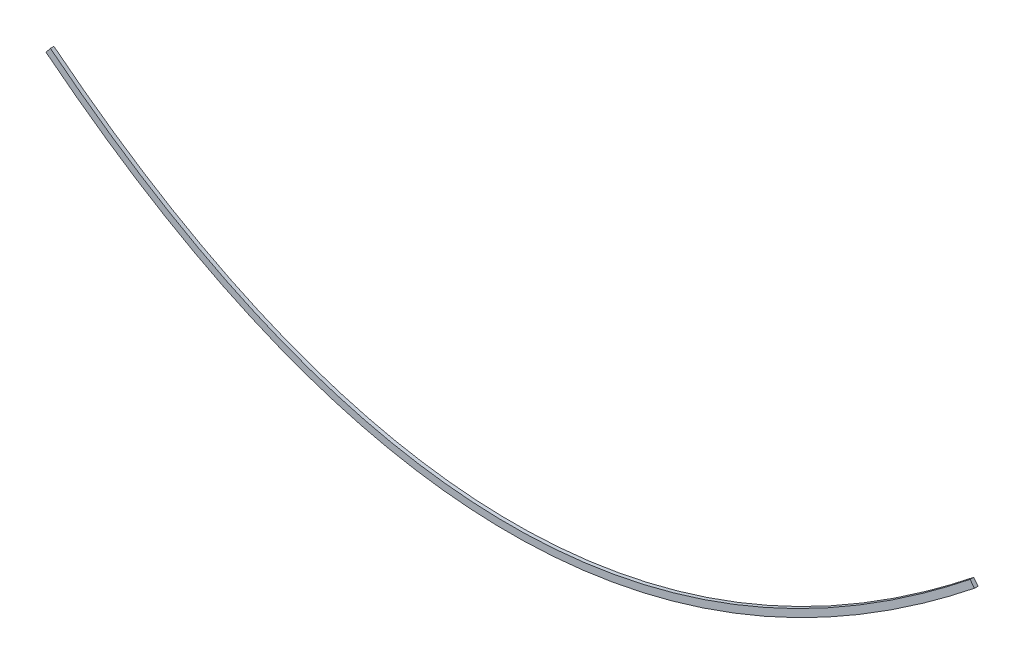
ISO-10303-21;
HEADER;
FILE_DESCRIPTION(('STEP AP214'),'2;1');
FILE_NAME('part.step','',(''),(''),'','','');
FILE_SCHEMA(('AUTOMOTIVE_DESIGN { 1 0 10303 214 1 1 1 1 }'));
ENDSEC;
DATA;
#1=APPLICATION_CONTEXT('core data for automotive mechanical design processes');
#2=APPLICATION_PROTOCOL_DEFINITION('international standard','automotive_design',2000,#1);
#3=PRODUCT_CONTEXT('',#1,'mechanical');
#4=PRODUCT('Part','Part','',(#3));
#5=PRODUCT_RELATED_PRODUCT_CATEGORY('part','',(#4));
#6=PRODUCT_DEFINITION_FORMATION('','',#4);
#7=PRODUCT_DEFINITION_CONTEXT('part definition',#1,'design');
#8=PRODUCT_DEFINITION('design','',#6,#7);
#9=PRODUCT_DEFINITION_SHAPE('','',#8);
#10=(LENGTH_UNIT() NAMED_UNIT(*) SI_UNIT(.MILLI.,.METRE.));
#11=(NAMED_UNIT(*) PLANE_ANGLE_UNIT() SI_UNIT($,.RADIAN.));
#12=(NAMED_UNIT(*) SI_UNIT($,.STERADIAN.) SOLID_ANGLE_UNIT());
#13=UNCERTAINTY_MEASURE_WITH_UNIT(LENGTH_MEASURE(1.E-05),#10,'distance_accuracy_value','');
#14=(GEOMETRIC_REPRESENTATION_CONTEXT(3) GLOBAL_UNCERTAINTY_ASSIGNED_CONTEXT((#13)) GLOBAL_UNIT_ASSIGNED_CONTEXT((#10,
#11,#12)) REPRESENTATION_CONTEXT('',''));
#15=CARTESIAN_POINT('',(0.,0.,0.));
#16=DIRECTION('',(0.,0.,1.));
#17=DIRECTION('',(1.,0.,0.));
#18=AXIS2_PLACEMENT_3D('',#15,#16,#17);
#19=CARTESIAN_POINT('',(-1316.86627778561,513.594593576516,10.));
#20=CARTESIAN_POINT('',(-1207.32856398353,426.438501760189,10.));
#21=CARTESIAN_POINT('',(-1097.74431050093,350.139448286762,10.));
#22=CARTESIAN_POINT('',(-878.464583952773,219.283394350236,10.));
#23=CARTESIAN_POINT('',(-768.768474048777,164.726519406467,10.));
#24=CARTESIAN_POINT('',(-549.264658939787,77.3999996187593,10.));
#25=CARTESIAN_POINT('',(-439.456522515046,44.6311540347239,10.));
#26=CARTESIAN_POINT('',(-219.765390207726,0.930633378408788,10.));
#27=CARTESIAN_POINT('',(-109.883059999976,-10.0000000000088,10.));
#28=CARTESIAN_POINT('',(109.883060000039,-10.0000000000141,10.));
#29=CARTESIAN_POINT('',(219.765390207787,0.930633378398086,10.));
#30=CARTESIAN_POINT('',(439.456522515098,44.6311540347026,10.));
#31=CARTESIAN_POINT('',(549.264658939831,77.3999996187327,10.));
#32=CARTESIAN_POINT('',(768.768474048802,164.72651940643,10.));
#33=CARTESIAN_POINT('',(878.464583952787,219.283394350194,10.));
#34=CARTESIAN_POINT('',(1097.74431050092,350.139448286709,10.));
#35=CARTESIAN_POINT('',(1207.3285639835,426.438501760131,10.));
#36=CARTESIAN_POINT('',(1316.86627778556,513.594593576453,10.));
#37=B_SPLINE_CURVE_WITH_KNOTS('',3,(#19,#20,#21,#22,#23,#24,#25,#26,#27,#28,#29,#30,#31,#32,#33,
#34,#35,#36),.UNSPECIFIED.,.F.,.F.,(4,2,2,2,2,2,2,2,4),(0.,0.125,0.25,0.375,0.5,0.625,0.75,
0.875,1.),.UNSPECIFIED.);
#38=DIRECTION('',(0.,0.,-1.));
#39=VECTOR('',#38,1.);
#40=SURFACE_OF_LINEAR_EXTRUSION('',#37,#39);
#41=CARTESIAN_POINT('',(-1316.86627778561,513.594593576516,0.));
#42=CARTESIAN_POINT('',(-1207.32856398353,426.438501760189,0.));
#43=CARTESIAN_POINT('',(-1097.74431050093,350.139448286762,0.));
#44=CARTESIAN_POINT('',(-878.464583952773,219.283394350236,0.));
#45=CARTESIAN_POINT('',(-768.768474048777,164.726519406467,0.));
#46=CARTESIAN_POINT('',(-549.264658939787,77.3999996187593,0.));
#47=CARTESIAN_POINT('',(-439.456522515046,44.6311540347239,0.));
#48=CARTESIAN_POINT('',(-219.765390207726,0.930633378408788,0.));
#49=CARTESIAN_POINT('',(-109.883059999976,-10.0000000000088,0.));
#50=CARTESIAN_POINT('',(109.883060000039,-10.0000000000141,0.));
#51=CARTESIAN_POINT('',(219.765390207787,0.930633378398086,0.));
#52=CARTESIAN_POINT('',(439.456522515098,44.6311540347026,0.));
#53=CARTESIAN_POINT('',(549.264658939831,77.3999996187327,0.));
#54=CARTESIAN_POINT('',(768.768474048802,164.72651940643,0.));
#55=CARTESIAN_POINT('',(878.464583952787,219.283394350194,0.));
#56=CARTESIAN_POINT('',(1097.74431050092,350.139448286709,0.));
#57=CARTESIAN_POINT('',(1207.3285639835,426.438501760131,0.));
#58=CARTESIAN_POINT('',(1316.86627778556,513.594593576453,0.));
#59=B_SPLINE_CURVE_WITH_KNOTS('',3,(#41,#42,#43,#44,#45,#46,#47,#48,#49,#50,#51,#52,#53,#54,#55,
#56,#57,#58),.UNSPECIFIED.,.F.,.F.,(4,2,2,2,2,2,2,2,4),(0.,0.125,0.25,0.375,0.5,0.625,0.75,
0.875,1.),.UNSPECIFIED.);
#60=CARTESIAN_POINT('',(-1316.86627778561,513.594593576516,0.));
#61=VERTEX_POINT('',#60);
#62=CARTESIAN_POINT('',(1316.86627778556,513.594593576453,0.));
#63=VERTEX_POINT('',#62);
#64=EDGE_CURVE('E128',#61,#63,#59,.T.);
#65=ORIENTED_EDGE('',*,*,#64,.T.);
#66=DIRECTION('',(0.,0.,-1.));
#67=VECTOR('',#66,1.);
#68=CARTESIAN_POINT('',(1316.86627778556,513.594593576453,10.));
#69=LINE('',#68,#67);
#70=CARTESIAN_POINT('',(1316.86627778556,513.594593576453,10.));
#71=VERTEX_POINT('',#70);
#72=EDGE_CURVE('E11',#71,#63,#69,.T.);
#73=ORIENTED_EDGE('',*,*,#72,.F.);
#74=CARTESIAN_POINT('',(-1316.86627778561,513.594593576516,10.));
#75=VERTEX_POINT('',#74);
#76=EDGE_CURVE('E85',#75,#71,#37,.T.);
#77=ORIENTED_EDGE('',*,*,#76,.F.);
#78=DIRECTION('',(0.,0.,-1.));
#79=VECTOR('',#78,1.);
#80=CARTESIAN_POINT('',(-1316.86627778561,513.594593576516,10.));
#81=LINE('',#80,#79);
#82=EDGE_CURVE('E61',#75,#61,#81,.T.);
#83=ORIENTED_EDGE('',*,*,#82,.T.);
#84=EDGE_LOOP('',(#65,#73,#77,#83));
#85=FACE_BOUND('',#84,.T.);
#86=ADVANCED_FACE('F43',(#85),#40,.F.);
#87=CARTESIAN_POINT('',(1304.41372221458,529.244956503609,10.));
#88=DIRECTION('',(0.782518146357816,0.622627778548892,0.));
#89=DIRECTION('',(-0.622627778548892,0.782518146357816,0.));
#90=AXIS2_PLACEMENT_3D('',#87,#88,#89);
#91=PLANE('',#90);
#92=DIRECTION('',(0.622627778548892,-0.782518146357816,0.));
#93=VECTOR('',#92,1.);
#94=CARTESIAN_POINT('',(1304.41372221458,529.244956503609,0.));
#95=LINE('',#94,#93);
#96=CARTESIAN_POINT('',(1304.41372221458,529.244956503609,0.));
#97=VERTEX_POINT('',#96);
#98=EDGE_CURVE('E94',#97,#63,#95,.T.);
#99=ORIENTED_EDGE('',*,*,#98,.F.);
#100=DIRECTION('',(0.,0.,-1.));
#101=VECTOR('',#100,1.);
#102=CARTESIAN_POINT('',(1304.41372221458,529.244956503609,10.));
#103=LINE('',#102,#101);
#104=CARTESIAN_POINT('',(1304.41372221458,529.244956503609,10.));
#105=VERTEX_POINT('',#104);
#106=EDGE_CURVE('E53',#105,#97,#103,.T.);
#107=ORIENTED_EDGE('',*,*,#106,.F.);
#108=DIRECTION('',(0.622627778548892,-0.782518146357816,0.));
#109=VECTOR('',#108,1.);
#110=CARTESIAN_POINT('',(1304.41372221458,529.244956503609,10.));
#111=LINE('',#110,#109);
#112=EDGE_CURVE('E92',#105,#71,#111,.T.);
#113=ORIENTED_EDGE('',*,*,#112,.T.);
#114=ORIENTED_EDGE('',*,*,#72,.T.);
#115=EDGE_LOOP('',(#99,#107,#113,#114));
#116=FACE_BOUND('',#115,.T.);
#117=ADVANCED_FACE('F91',(#116),#91,.T.);
#118=CARTESIAN_POINT('',(-1304.41372221463,529.244956503673,10.));
#119=CARTESIAN_POINT('',(-1195.51143601667,442.594456639971,10.));
#120=CARTESIAN_POINT('',(-1086.65568949924,366.812742393371,10.));
#121=CARTESIAN_POINT('',(-869.055416047338,236.958908809848,10.));
#122=CARTESIAN_POINT('',(-760.311525951307,182.886663953597,10.));
#123=CARTESIAN_POINT('',(-542.935341060246,96.4065920612692,10.));
#124=CARTESIAN_POINT('',(-434.303477484965,63.9979657652901,10.));
#125=CARTESIAN_POINT('',(-217.114609792244,20.7951905815821,10.));
#126=CARTESIAN_POINT('',(-108.556939999976,9.99999999999121,10.));
#127=CARTESIAN_POINT('',(108.55694000004,9.99999999998593,10.));
#128=CARTESIAN_POINT('',(217.114609792306,20.7951905815716,10.));
#129=CARTESIAN_POINT('',(434.303477485017,63.9979657652689,10.));
#130=CARTESIAN_POINT('',(542.93534106029,96.4065920612427,10.));
#131=CARTESIAN_POINT('',(760.311525951332,182.88666395356,10.));
#132=CARTESIAN_POINT('',(869.055416047351,236.958908809806,10.));
#133=CARTESIAN_POINT('',(1086.65568949922,366.812742393318,10.));
#134=CARTESIAN_POINT('',(1195.51143601664,442.594456639912,10.));
#135=CARTESIAN_POINT('',(1304.41372221458,529.244956503609,10.));
#136=B_SPLINE_CURVE_WITH_KNOTS('',3,(#118,#119,#120,#121,#122,#123,#124,#125,#126,#127,#128,
#129,#130,#131,#132,#133,#134,#135),.UNSPECIFIED.,.F.,.F.,(4,2,2,2,2,2,2,2,4),(0.,0.125,0.25,
0.375,0.5,0.625,0.75,0.875,1.),.UNSPECIFIED.);
#137=DIRECTION('',(0.,0.,-1.));
#138=VECTOR('',#137,1.);
#139=SURFACE_OF_LINEAR_EXTRUSION('',#136,#138);
#140=CARTESIAN_POINT('',(-1304.41372221463,529.244956503673,0.));
#141=CARTESIAN_POINT('',(-1195.51143601667,442.594456639971,0.));
#142=CARTESIAN_POINT('',(-1086.65568949924,366.812742393371,0.));
#143=CARTESIAN_POINT('',(-869.055416047338,236.958908809848,0.));
#144=CARTESIAN_POINT('',(-760.311525951307,182.886663953597,0.));
#145=CARTESIAN_POINT('',(-542.935341060246,96.4065920612692,0.));
#146=CARTESIAN_POINT('',(-434.303477484965,63.9979657652901,0.));
#147=CARTESIAN_POINT('',(-217.114609792244,20.7951905815821,0.));
#148=CARTESIAN_POINT('',(-108.556939999976,9.99999999999121,0.));
#149=CARTESIAN_POINT('',(108.55694000004,9.99999999998593,0.));
#150=CARTESIAN_POINT('',(217.114609792306,20.7951905815716,0.));
#151=CARTESIAN_POINT('',(434.303477485017,63.9979657652689,0.));
#152=CARTESIAN_POINT('',(542.93534106029,96.4065920612427,0.));
#153=CARTESIAN_POINT('',(760.311525951332,182.88666395356,0.));
#154=CARTESIAN_POINT('',(869.055416047351,236.958908809806,0.));
#155=CARTESIAN_POINT('',(1086.65568949922,366.812742393318,0.));
#156=CARTESIAN_POINT('',(1195.51143601664,442.594456639912,0.));
#157=CARTESIAN_POINT('',(1304.41372221458,529.244956503609,0.));
#158=B_SPLINE_CURVE_WITH_KNOTS('',3,(#140,#141,#142,#143,#144,#145,#146,#147,#148,#149,#150,
#151,#152,#153,#154,#155,#156,#157),.UNSPECIFIED.,.F.,.F.,(4,2,2,2,2,2,2,2,4),(0.,0.125,0.25,
0.375,0.5,0.625,0.75,0.875,1.),.UNSPECIFIED.);
#159=CARTESIAN_POINT('',(-1304.41372221463,529.244956503673,0.));
#160=VERTEX_POINT('',#159);
#161=EDGE_CURVE('E133',#160,#97,#158,.T.);
#162=ORIENTED_EDGE('',*,*,#161,.F.);
#163=DIRECTION('',(0.,0.,-1.));
#164=VECTOR('',#163,1.);
#165=CARTESIAN_POINT('',(-1304.41372221463,529.244956503673,10.));
#166=LINE('',#165,#164);
#167=CARTESIAN_POINT('',(-1304.41372221463,529.244956503673,10.));
#168=VERTEX_POINT('',#167);
#169=EDGE_CURVE('E74',#168,#160,#166,.T.);
#170=ORIENTED_EDGE('',*,*,#169,.F.);
#171=EDGE_CURVE('E101',#168,#105,#136,.T.);
#172=ORIENTED_EDGE('',*,*,#171,.T.);
#173=ORIENTED_EDGE('',*,*,#106,.T.);
#174=EDGE_LOOP('',(#162,#170,#172,#173));
#175=FACE_BOUND('',#174,.T.);
#176=ADVANCED_FACE('F104',(#175),#139,.T.);
#177=CARTESIAN_POINT('',(-1316.86627778561,513.594593576516,10.));
#178=DIRECTION('',(-0.78251814635785,0.622627778548848,0.));
#179=DIRECTION('',(-0.622627778548848,-0.78251814635785,0.));
#180=AXIS2_PLACEMENT_3D('',#177,#178,#179);
#181=PLANE('',#180);
#182=DIRECTION('',(0.622627778548848,0.78251814635785,0.));
#183=VECTOR('',#182,1.);
#184=CARTESIAN_POINT('',(-1316.86627778561,513.594593576516,0.));
#185=LINE('',#184,#183);
#186=EDGE_CURVE('E137',#61,#160,#185,.T.);
#187=ORIENTED_EDGE('',*,*,#186,.F.);
#188=ORIENTED_EDGE('',*,*,#82,.F.);
#189=DIRECTION('',(0.622627778548848,0.78251814635785,0.));
#190=VECTOR('',#189,1.);
#191=CARTESIAN_POINT('',(-1316.86627778561,513.594593576516,10.));
#192=LINE('',#191,#190);
#193=EDGE_CURVE('E106',#75,#168,#192,.T.);
#194=ORIENTED_EDGE('',*,*,#193,.T.);
#195=ORIENTED_EDGE('',*,*,#169,.T.);
#196=EDGE_LOOP('',(#187,#188,#194,#195));
#197=FACE_BOUND('',#196,.T.);
#198=ADVANCED_FACE('F120',(#197),#181,.T.);
#199=CARTESIAN_POINT('',(3.21774560241295E-11,-10.0000000000114,10.));
#200=DIRECTION('',(0.,0.,-1.));
#201=DIRECTION('',(-1.,0.,0.));
#202=AXIS2_PLACEMENT_3D('',#199,#200,#201);
#203=PLANE('',#202);
#204=ORIENTED_EDGE('',*,*,#76,.T.);
#205=ORIENTED_EDGE('',*,*,#112,.F.);
#206=ORIENTED_EDGE('',*,*,#171,.F.);
#207=ORIENTED_EDGE('',*,*,#193,.F.);
#208=EDGE_LOOP('',(#204,#205,#206,#207));
#209=FACE_BOUND('',#208,.T.);
#210=ADVANCED_FACE('F100',(#209),#203,.F.);
#211=CARTESIAN_POINT('',(3.21774560241295E-11,-10.0000000000114,0.));
#212=DIRECTION('',(0.,0.,-1.));
#213=DIRECTION('',(-1.,0.,0.));
#214=AXIS2_PLACEMENT_3D('',#211,#212,#213);
#215=PLANE('',#214);
#216=ORIENTED_EDGE('',*,*,#64,.F.);
#217=ORIENTED_EDGE('',*,*,#186,.T.);
#218=ORIENTED_EDGE('',*,*,#161,.T.);
#219=ORIENTED_EDGE('',*,*,#98,.T.);
#220=EDGE_LOOP('',(#216,#217,#218,#219));
#221=FACE_BOUND('',#220,.T.);
#222=ADVANCED_FACE('F132',(#221),#215,.T.);
#223=CLOSED_SHELL('',(#86,#117,#176,#198,#210,#222));
#224=MANIFOLD_SOLID_BREP('B2',#223);
#225=ADVANCED_BREP_SHAPE_REPRESENTATION('',(#18,#224),#14);
#226=SHAPE_DEFINITION_REPRESENTATION(#9,#225);
ENDSEC;
END-ISO-10303-21;
